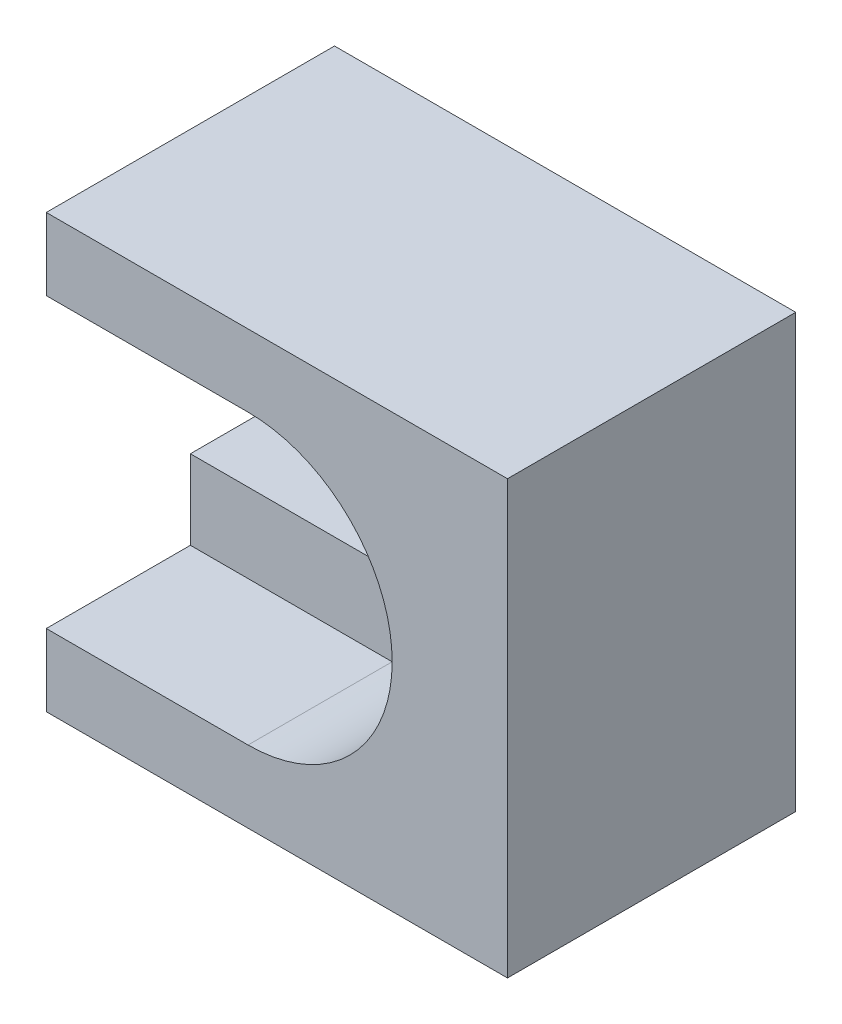
ISO-10303-21;
HEADER;
FILE_DESCRIPTION(('STEP AP214'),'2;1');
FILE_NAME('part.step','',(''),(''),'','','');
FILE_SCHEMA(('AUTOMOTIVE_DESIGN { 1 0 10303 214 1 1 1 1 }'));
ENDSEC;
DATA;
#1=APPLICATION_CONTEXT('core data for automotive mechanical design processes');
#2=APPLICATION_PROTOCOL_DEFINITION('international standard','automotive_design',2000,#1);
#3=PRODUCT_CONTEXT('',#1,'mechanical');
#4=PRODUCT('Part','Part','',(#3));
#5=PRODUCT_RELATED_PRODUCT_CATEGORY('part','',(#4));
#6=PRODUCT_DEFINITION_FORMATION('','',#4);
#7=PRODUCT_DEFINITION_CONTEXT('part definition',#1,'design');
#8=PRODUCT_DEFINITION('design','',#6,#7);
#9=PRODUCT_DEFINITION_SHAPE('','',#8);
#10=(LENGTH_UNIT() NAMED_UNIT(*) SI_UNIT(.MILLI.,.METRE.));
#11=(NAMED_UNIT(*) PLANE_ANGLE_UNIT() SI_UNIT($,.RADIAN.));
#12=(NAMED_UNIT(*) SI_UNIT($,.STERADIAN.) SOLID_ANGLE_UNIT());
#13=UNCERTAINTY_MEASURE_WITH_UNIT(LENGTH_MEASURE(1.E-05),#10,'distance_accuracy_value','');
#14=(GEOMETRIC_REPRESENTATION_CONTEXT(3) GLOBAL_UNCERTAINTY_ASSIGNED_CONTEXT((#13)) GLOBAL_UNIT_ASSIGNED_CONTEXT((#10,
#11,#12)) REPRESENTATION_CONTEXT('',''));
#15=CARTESIAN_POINT('',(0.,0.,0.));
#16=DIRECTION('',(0.,0.,1.));
#17=DIRECTION('',(1.,0.,0.));
#18=AXIS2_PLACEMENT_3D('',#15,#16,#17);
#19=CARTESIAN_POINT('',(0.,0.,10.));
#20=DIRECTION('',(1.,0.,0.));
#21=DIRECTION('',(0.,0.,-1.));
#22=AXIS2_PLACEMENT_3D('',#19,#20,#21);
#23=PLANE('',#22);
#24=DIRECTION('',(0.,-1.,0.));
#25=VECTOR('',#24,1.);
#26=CARTESIAN_POINT('',(0.,0.,0.));
#27=LINE('',#26,#25);
#28=CARTESIAN_POINT('',(0.,15.,0.));
#29=VERTEX_POINT('',#28);
#30=CARTESIAN_POINT('',(0.,9.75,0.));
#31=VERTEX_POINT('',#30);
#32=EDGE_CURVE('E145',#29,#31,#27,.T.);
#33=ORIENTED_EDGE('',*,*,#32,.T.);
#34=DIRECTION('',(0.,0.,1.));
#35=VECTOR('',#34,1.);
#36=CARTESIAN_POINT('',(0.,9.75,0.));
#37=LINE('',#36,#35);
#38=CARTESIAN_POINT('',(0.,9.75,5.));
#39=VERTEX_POINT('',#38);
#40=EDGE_CURVE('E224',#31,#39,#37,.T.);
#41=ORIENTED_EDGE('',*,*,#40,.T.);
#42=DIRECTION('',(0.,-1.,0.));
#43=VECTOR('',#42,1.);
#44=CARTESIAN_POINT('',(0.,0.,5.));
#45=LINE('',#44,#43);
#46=CARTESIAN_POINT('',(0.,12.5,5.));
#47=VERTEX_POINT('',#46);
#48=EDGE_CURVE('E11',#47,#39,#45,.T.);
#49=ORIENTED_EDGE('',*,*,#48,.F.);
#50=DIRECTION('',(0.,0.,1.));
#51=VECTOR('',#50,1.);
#52=CARTESIAN_POINT('',(0.,12.5,5.));
#53=LINE('',#52,#51);
#54=CARTESIAN_POINT('',(0.,12.5,10.));
#55=VERTEX_POINT('',#54);
#56=EDGE_CURVE('E146',#47,#55,#53,.T.);
#57=ORIENTED_EDGE('',*,*,#56,.T.);
#58=DIRECTION('',(0.,-1.,0.));
#59=VECTOR('',#58,1.);
#60=CARTESIAN_POINT('',(0.,0.,10.));
#61=LINE('',#60,#59);
#62=CARTESIAN_POINT('',(0.,15.,10.));
#63=VERTEX_POINT('',#62);
#64=EDGE_CURVE('E195',#63,#55,#61,.T.);
#65=ORIENTED_EDGE('',*,*,#64,.F.);
#66=DIRECTION('',(0.,0.,-1.));
#67=VECTOR('',#66,1.);
#68=CARTESIAN_POINT('',(0.,15.,10.));
#69=LINE('',#68,#67);
#70=EDGE_CURVE('E162',#63,#29,#69,.T.);
#71=ORIENTED_EDGE('',*,*,#70,.T.);
#72=EDGE_LOOP('',(#33,#41,#49,#57,#65,#71));
#73=FACE_BOUND('',#72,.T.);
#74=ADVANCED_FACE('F33',(#73),#23,.F.);
#75=CARTESIAN_POINT('',(0.,5.25,5.));
#76=VERTEX_POINT('',#75);
#77=CARTESIAN_POINT('',(0.,2.5,5.));
#78=VERTEX_POINT('',#77);
#79=EDGE_CURVE('E41',#76,#78,#45,.T.);
#80=ORIENTED_EDGE('',*,*,#79,.F.);
#81=DIRECTION('',(0.,0.,1.));
#82=VECTOR('',#81,1.);
#83=CARTESIAN_POINT('',(0.,5.25,0.));
#84=LINE('',#83,#82);
#85=CARTESIAN_POINT('',(0.,5.25,0.));
#86=VERTEX_POINT('',#85);
#87=EDGE_CURVE('E48',#86,#76,#84,.T.);
#88=ORIENTED_EDGE('',*,*,#87,.F.);
#89=CARTESIAN_POINT('',(0.,0.,0.));
#90=VERTEX_POINT('',#89);
#91=EDGE_CURVE('E136',#86,#90,#27,.T.);
#92=ORIENTED_EDGE('',*,*,#91,.T.);
#93=DIRECTION('',(0.,0.,-1.));
#94=VECTOR('',#93,1.);
#95=CARTESIAN_POINT('',(0.,0.,10.));
#96=LINE('',#95,#94);
#97=CARTESIAN_POINT('',(0.,0.,10.));
#98=VERTEX_POINT('',#97);
#99=EDGE_CURVE('E170',#98,#90,#96,.T.);
#100=ORIENTED_EDGE('',*,*,#99,.F.);
#101=CARTESIAN_POINT('',(0.,2.5,10.));
#102=VERTEX_POINT('',#101);
#103=EDGE_CURVE('E161',#102,#98,#61,.T.);
#104=ORIENTED_EDGE('',*,*,#103,.F.);
#105=DIRECTION('',(0.,0.,1.));
#106=VECTOR('',#105,1.);
#107=CARTESIAN_POINT('',(0.,2.5,5.));
#108=LINE('',#107,#106);
#109=EDGE_CURVE('E56',#78,#102,#108,.T.);
#110=ORIENTED_EDGE('',*,*,#109,.F.);
#111=EDGE_LOOP('',(#80,#88,#92,#100,#104,#110));
#112=FACE_BOUND('',#111,.T.);
#113=ADVANCED_FACE('F35',(#112),#23,.F.);
#114=CARTESIAN_POINT('',(0.,0.,10.));
#115=DIRECTION('',(0.,1.,0.));
#116=DIRECTION('',(0.,0.,1.));
#117=AXIS2_PLACEMENT_3D('',#114,#115,#116);
#118=PLANE('',#117);
#119=DIRECTION('',(1.,0.,0.));
#120=VECTOR('',#119,1.);
#121=CARTESIAN_POINT('',(0.,0.,0.));
#122=LINE('',#121,#120);
#123=CARTESIAN_POINT('',(16.,0.,0.));
#124=VERTEX_POINT('',#123);
#125=EDGE_CURVE('E143',#90,#124,#122,.T.);
#126=ORIENTED_EDGE('',*,*,#125,.T.);
#127=DIRECTION('',(0.,0.,-1.));
#128=VECTOR('',#127,1.);
#129=CARTESIAN_POINT('',(16.,0.,10.));
#130=LINE('',#129,#128);
#131=CARTESIAN_POINT('',(16.,0.,10.));
#132=VERTEX_POINT('',#131);
#133=EDGE_CURVE('E168',#132,#124,#130,.T.);
#134=ORIENTED_EDGE('',*,*,#133,.F.);
#135=DIRECTION('',(1.,0.,0.));
#136=VECTOR('',#135,1.);
#137=CARTESIAN_POINT('',(0.,0.,10.));
#138=LINE('',#137,#136);
#139=EDGE_CURVE('E198',#98,#132,#138,.T.);
#140=ORIENTED_EDGE('',*,*,#139,.F.);
#141=ORIENTED_EDGE('',*,*,#99,.T.);
#142=EDGE_LOOP('',(#126,#134,#140,#141));
#143=FACE_BOUND('',#142,.T.);
#144=ADVANCED_FACE('F230',(#143),#118,.F.);
#145=CARTESIAN_POINT('',(16.,0.,10.));
#146=DIRECTION('',(-1.,0.,0.));
#147=DIRECTION('',(0.,0.,1.));
#148=AXIS2_PLACEMENT_3D('',#145,#146,#147);
#149=PLANE('',#148);
#150=DIRECTION('',(0.,1.,0.));
#151=VECTOR('',#150,1.);
#152=CARTESIAN_POINT('',(16.,0.,0.));
#153=LINE('',#152,#151);
#154=CARTESIAN_POINT('',(16.,15.,0.));
#155=VERTEX_POINT('',#154);
#156=EDGE_CURVE('E157',#124,#155,#153,.T.);
#157=ORIENTED_EDGE('',*,*,#156,.T.);
#158=DIRECTION('',(0.,0.,-1.));
#159=VECTOR('',#158,1.);
#160=CARTESIAN_POINT('',(16.,15.,10.));
#161=LINE('',#160,#159);
#162=CARTESIAN_POINT('',(16.,15.,10.));
#163=VERTEX_POINT('',#162);
#164=EDGE_CURVE('E165',#163,#155,#161,.T.);
#165=ORIENTED_EDGE('',*,*,#164,.F.);
#166=DIRECTION('',(0.,1.,0.));
#167=VECTOR('',#166,1.);
#168=CARTESIAN_POINT('',(16.,0.,10.));
#169=LINE('',#168,#167);
#170=EDGE_CURVE('E199',#132,#163,#169,.T.);
#171=ORIENTED_EDGE('',*,*,#170,.F.);
#172=ORIENTED_EDGE('',*,*,#133,.T.);
#173=EDGE_LOOP('',(#157,#165,#171,#172));
#174=FACE_BOUND('',#173,.T.);
#175=ADVANCED_FACE('F232',(#174),#149,.F.);
#176=CARTESIAN_POINT('',(0.,15.,10.));
#177=DIRECTION('',(0.,-1.,0.));
#178=DIRECTION('',(0.,0.,-1.));
#179=AXIS2_PLACEMENT_3D('',#176,#177,#178);
#180=PLANE('',#179);
#181=DIRECTION('',(-1.,0.,0.));
#182=VECTOR('',#181,1.);
#183=CARTESIAN_POINT('',(0.,15.,0.));
#184=LINE('',#183,#182);
#185=EDGE_CURVE('E159',#155,#29,#184,.T.);
#186=ORIENTED_EDGE('',*,*,#185,.T.);
#187=ORIENTED_EDGE('',*,*,#70,.F.);
#188=DIRECTION('',(-1.,0.,0.));
#189=VECTOR('',#188,1.);
#190=CARTESIAN_POINT('',(0.,15.,10.));
#191=LINE('',#190,#189);
#192=EDGE_CURVE('E154',#163,#63,#191,.T.);
#193=ORIENTED_EDGE('',*,*,#192,.F.);
#194=ORIENTED_EDGE('',*,*,#164,.T.);
#195=EDGE_LOOP('',(#186,#187,#193,#194));
#196=FACE_BOUND('',#195,.T.);
#197=ADVANCED_FACE('F209',(#196),#180,.F.);
#198=CARTESIAN_POINT('',(0.,0.,10.));
#199=DIRECTION('',(0.,0.,-1.));
#200=DIRECTION('',(-1.,0.,0.));
#201=AXIS2_PLACEMENT_3D('',#198,#199,#200);
#202=PLANE('',#201);
#203=ORIENTED_EDGE('',*,*,#64,.T.);
#204=DIRECTION('',(-1.,0.,0.));
#205=VECTOR('',#204,1.);
#206=CARTESIAN_POINT('',(0.,12.5,10.));
#207=LINE('',#206,#205);
#208=CARTESIAN_POINT('',(7.,12.5,10.));
#209=VERTEX_POINT('',#208);
#210=EDGE_CURVE('E185',#209,#55,#207,.T.);
#211=ORIENTED_EDGE('',*,*,#210,.F.);
#212=CARTESIAN_POINT('',(7.,7.5,10.));
#213=DIRECTION('',(0.,0.,1.));
#214=DIRECTION('',(1.,0.,0.));
#215=AXIS2_PLACEMENT_3D('',#212,#213,#214);
#216=CIRCLE('',#215,5.);
#217=CARTESIAN_POINT('',(7.,2.5,10.));
#218=VERTEX_POINT('',#217);
#219=EDGE_CURVE('E223',#218,#209,#216,.T.);
#220=ORIENTED_EDGE('',*,*,#219,.F.);
#221=DIRECTION('',(1.,0.,0.));
#222=VECTOR('',#221,1.);
#223=CARTESIAN_POINT('',(0.,2.5,10.));
#224=LINE('',#223,#222);
#225=EDGE_CURVE('E221',#102,#218,#224,.T.);
#226=ORIENTED_EDGE('',*,*,#225,.F.);
#227=ORIENTED_EDGE('',*,*,#103,.T.);
#228=ORIENTED_EDGE('',*,*,#139,.T.);
#229=ORIENTED_EDGE('',*,*,#170,.T.);
#230=ORIENTED_EDGE('',*,*,#192,.T.);
#231=EDGE_LOOP('',(#203,#211,#220,#226,#227,#228,#229,#230));
#232=FACE_BOUND('',#231,.T.);
#233=ADVANCED_FACE('F205',(#232),#202,.F.);
#234=CARTESIAN_POINT('',(0.,0.,0.));
#235=DIRECTION('',(0.,0.,-1.));
#236=DIRECTION('',(-1.,0.,0.));
#237=AXIS2_PLACEMENT_3D('',#234,#235,#236);
#238=PLANE('',#237);
#239=DIRECTION('',(-1.,0.,0.));
#240=VECTOR('',#239,1.);
#241=CARTESIAN_POINT('',(0.,9.75,0.));
#242=LINE('',#241,#240);
#243=CARTESIAN_POINT('',(7.,9.75,0.));
#244=VERTEX_POINT('',#243);
#245=EDGE_CURVE('E138',#244,#31,#242,.T.);
#246=ORIENTED_EDGE('',*,*,#245,.T.);
#247=ORIENTED_EDGE('',*,*,#32,.F.);
#248=ORIENTED_EDGE('',*,*,#185,.F.);
#249=ORIENTED_EDGE('',*,*,#156,.F.);
#250=ORIENTED_EDGE('',*,*,#125,.F.);
#251=ORIENTED_EDGE('',*,*,#91,.F.);
#252=DIRECTION('',(1.,0.,0.));
#253=VECTOR('',#252,1.);
#254=CARTESIAN_POINT('',(0.,5.25,0.));
#255=LINE('',#254,#253);
#256=CARTESIAN_POINT('',(7.,5.25,0.));
#257=VERTEX_POINT('',#256);
#258=EDGE_CURVE('E123',#86,#257,#255,.T.);
#259=ORIENTED_EDGE('',*,*,#258,.T.);
#260=CARTESIAN_POINT('',(7.,7.5,0.));
#261=DIRECTION('',(0.,0.,1.));
#262=DIRECTION('',(1.,0.,0.));
#263=AXIS2_PLACEMENT_3D('',#260,#261,#262);
#264=CIRCLE('',#263,2.25);
#265=EDGE_CURVE('E130',#257,#244,#264,.T.);
#266=ORIENTED_EDGE('',*,*,#265,.T.);
#267=EDGE_LOOP('',(#246,#247,#248,#249,#250,#251,#259,#266));
#268=FACE_BOUND('',#267,.T.);
#269=ADVANCED_FACE('F141',(#268),#238,.T.);
#270=CARTESIAN_POINT('',(0.,7.5,5.));
#271=DIRECTION('',(0.,0.,1.));
#272=DIRECTION('',(1.,0.,0.));
#273=AXIS2_PLACEMENT_3D('',#270,#271,#272);
#274=PLANE('',#273);
#275=DIRECTION('',(-1.,0.,0.));
#276=VECTOR('',#275,1.);
#277=CARTESIAN_POINT('',(0.,9.75,5.));
#278=LINE('',#277,#276);
#279=CARTESIAN_POINT('',(7.,9.75,5.));
#280=VERTEX_POINT('',#279);
#281=EDGE_CURVE('E131',#280,#39,#278,.T.);
#282=ORIENTED_EDGE('',*,*,#281,.F.);
#283=CARTESIAN_POINT('',(7.,7.5,5.));
#284=DIRECTION('',(0.,0.,1.));
#285=DIRECTION('',(1.,0.,0.));
#286=AXIS2_PLACEMENT_3D('',#283,#284,#285);
#287=CIRCLE('',#286,2.25);
#288=CARTESIAN_POINT('',(7.,5.25,5.));
#289=VERTEX_POINT('',#288);
#290=EDGE_CURVE('E244',#289,#280,#287,.T.);
#291=ORIENTED_EDGE('',*,*,#290,.F.);
#292=DIRECTION('',(1.,0.,0.));
#293=VECTOR('',#292,1.);
#294=CARTESIAN_POINT('',(0.,5.25,5.));
#295=LINE('',#294,#293);
#296=EDGE_CURVE('E180',#76,#289,#295,.T.);
#297=ORIENTED_EDGE('',*,*,#296,.F.);
#298=ORIENTED_EDGE('',*,*,#79,.T.);
#299=DIRECTION('',(1.,0.,0.));
#300=VECTOR('',#299,1.);
#301=CARTESIAN_POINT('',(0.,2.5,5.));
#302=LINE('',#301,#300);
#303=CARTESIAN_POINT('',(7.,2.5,5.));
#304=VERTEX_POINT('',#303);
#305=EDGE_CURVE('E178',#78,#304,#302,.T.);
#306=ORIENTED_EDGE('',*,*,#305,.T.);
#307=CARTESIAN_POINT('',(7.,7.5,5.));
#308=DIRECTION('',(0.,0.,1.));
#309=DIRECTION('',(1.,0.,0.));
#310=AXIS2_PLACEMENT_3D('',#307,#308,#309);
#311=CIRCLE('',#310,5.);
#312=CARTESIAN_POINT('',(7.,12.5,5.));
#313=VERTEX_POINT('',#312);
#314=EDGE_CURVE('E184',#304,#313,#311,.T.);
#315=ORIENTED_EDGE('',*,*,#314,.T.);
#316=DIRECTION('',(-1.,0.,0.));
#317=VECTOR('',#316,1.);
#318=CARTESIAN_POINT('',(0.,12.5,5.));
#319=LINE('',#318,#317);
#320=EDGE_CURVE('E188',#313,#47,#319,.T.);
#321=ORIENTED_EDGE('',*,*,#320,.T.);
#322=ORIENTED_EDGE('',*,*,#48,.T.);
#323=EDGE_LOOP('',(#282,#291,#297,#298,#306,#315,#321,#322));
#324=FACE_BOUND('',#323,.T.);
#325=ADVANCED_FACE('F176',(#324),#274,.T.);
#326=CARTESIAN_POINT('',(0.,12.5,5.));
#327=DIRECTION('',(0.,1.,0.));
#328=DIRECTION('',(-1.,0.,0.));
#329=AXIS2_PLACEMENT_3D('',#326,#327,#328);
#330=PLANE('',#329);
#331=ORIENTED_EDGE('',*,*,#210,.T.);
#332=ORIENTED_EDGE('',*,*,#56,.F.);
#333=ORIENTED_EDGE('',*,*,#320,.F.);
#334=DIRECTION('',(0.,0.,1.));
#335=VECTOR('',#334,1.);
#336=CARTESIAN_POINT('',(7.,12.5,5.));
#337=LINE('',#336,#335);
#338=EDGE_CURVE('E150',#313,#209,#337,.T.);
#339=ORIENTED_EDGE('',*,*,#338,.T.);
#340=EDGE_LOOP('',(#331,#332,#333,#339));
#341=FACE_BOUND('',#340,.T.);
#342=ADVANCED_FACE('F217',(#341),#330,.F.);
#343=CARTESIAN_POINT('',(7.,7.5,5.));
#344=DIRECTION('',(0.,0.,1.));
#345=DIRECTION('',(1.,0.,0.));
#346=AXIS2_PLACEMENT_3D('',#343,#344,#345);
#347=CYLINDRICAL_SURFACE('',#346,5.);
#348=ORIENTED_EDGE('',*,*,#219,.T.);
#349=ORIENTED_EDGE('',*,*,#338,.F.);
#350=ORIENTED_EDGE('',*,*,#314,.F.);
#351=DIRECTION('',(0.,0.,1.));
#352=VECTOR('',#351,1.);
#353=CARTESIAN_POINT('',(7.,2.5,5.));
#354=LINE('',#353,#352);
#355=EDGE_CURVE('E182',#304,#218,#354,.T.);
#356=ORIENTED_EDGE('',*,*,#355,.T.);
#357=EDGE_LOOP('',(#348,#349,#350,#356));
#358=FACE_BOUND('',#357,.T.);
#359=ADVANCED_FACE('F228',(#358),#347,.F.);
#360=CARTESIAN_POINT('',(0.,2.5,5.));
#361=DIRECTION('',(0.,-1.,0.));
#362=DIRECTION('',(0.,0.,-1.));
#363=AXIS2_PLACEMENT_3D('',#360,#361,#362);
#364=PLANE('',#363);
#365=ORIENTED_EDGE('',*,*,#225,.T.);
#366=ORIENTED_EDGE('',*,*,#355,.F.);
#367=ORIENTED_EDGE('',*,*,#305,.F.);
#368=ORIENTED_EDGE('',*,*,#109,.T.);
#369=EDGE_LOOP('',(#365,#366,#367,#368));
#370=FACE_BOUND('',#369,.T.);
#371=ADVANCED_FACE('F181',(#370),#364,.F.);
#372=CARTESIAN_POINT('',(0.,9.75,0.));
#373=DIRECTION('',(0.,1.,0.));
#374=DIRECTION('',(-1.,0.,0.));
#375=AXIS2_PLACEMENT_3D('',#372,#373,#374);
#376=PLANE('',#375);
#377=ORIENTED_EDGE('',*,*,#281,.T.);
#378=ORIENTED_EDGE('',*,*,#40,.F.);
#379=ORIENTED_EDGE('',*,*,#245,.F.);
#380=DIRECTION('',(0.,0.,1.));
#381=VECTOR('',#380,1.);
#382=CARTESIAN_POINT('',(7.,9.75,0.));
#383=LINE('',#382,#381);
#384=EDGE_CURVE('E235',#244,#280,#383,.T.);
#385=ORIENTED_EDGE('',*,*,#384,.T.);
#386=EDGE_LOOP('',(#377,#378,#379,#385));
#387=FACE_BOUND('',#386,.T.);
#388=ADVANCED_FACE('F248',(#387),#376,.F.);
#389=CARTESIAN_POINT('',(7.,7.5,0.));
#390=DIRECTION('',(0.,0.,1.));
#391=DIRECTION('',(1.,0.,0.));
#392=AXIS2_PLACEMENT_3D('',#389,#390,#391);
#393=CYLINDRICAL_SURFACE('',#392,2.25);
#394=ORIENTED_EDGE('',*,*,#290,.T.);
#395=ORIENTED_EDGE('',*,*,#384,.F.);
#396=ORIENTED_EDGE('',*,*,#265,.F.);
#397=DIRECTION('',(0.,0.,1.));
#398=VECTOR('',#397,1.);
#399=CARTESIAN_POINT('',(7.,5.25,0.));
#400=LINE('',#399,#398);
#401=EDGE_CURVE('E125',#257,#289,#400,.T.);
#402=ORIENTED_EDGE('',*,*,#401,.T.);
#403=EDGE_LOOP('',(#394,#395,#396,#402));
#404=FACE_BOUND('',#403,.T.);
#405=ADVANCED_FACE('F243',(#404),#393,.F.);
#406=CARTESIAN_POINT('',(0.,5.25,0.));
#407=DIRECTION('',(0.,-1.,0.));
#408=DIRECTION('',(1.,0.,0.));
#409=AXIS2_PLACEMENT_3D('',#406,#407,#408);
#410=PLANE('',#409);
#411=ORIENTED_EDGE('',*,*,#296,.T.);
#412=ORIENTED_EDGE('',*,*,#401,.F.);
#413=ORIENTED_EDGE('',*,*,#258,.F.);
#414=ORIENTED_EDGE('',*,*,#87,.T.);
#415=EDGE_LOOP('',(#411,#412,#413,#414));
#416=FACE_BOUND('',#415,.T.);
#417=ADVANCED_FACE('F124',(#416),#410,.F.);
#418=CLOSED_SHELL('',(#74,#113,#144,#175,#197,#233,#269,#325,#342,#359,#371,#388,#405,#417));
#419=MANIFOLD_SOLID_BREP('B2',#418);
#420=ADVANCED_BREP_SHAPE_REPRESENTATION('',(#18,#419),#14);
#421=SHAPE_DEFINITION_REPRESENTATION(#9,#420);
ENDSEC;
END-ISO-10303-21;
